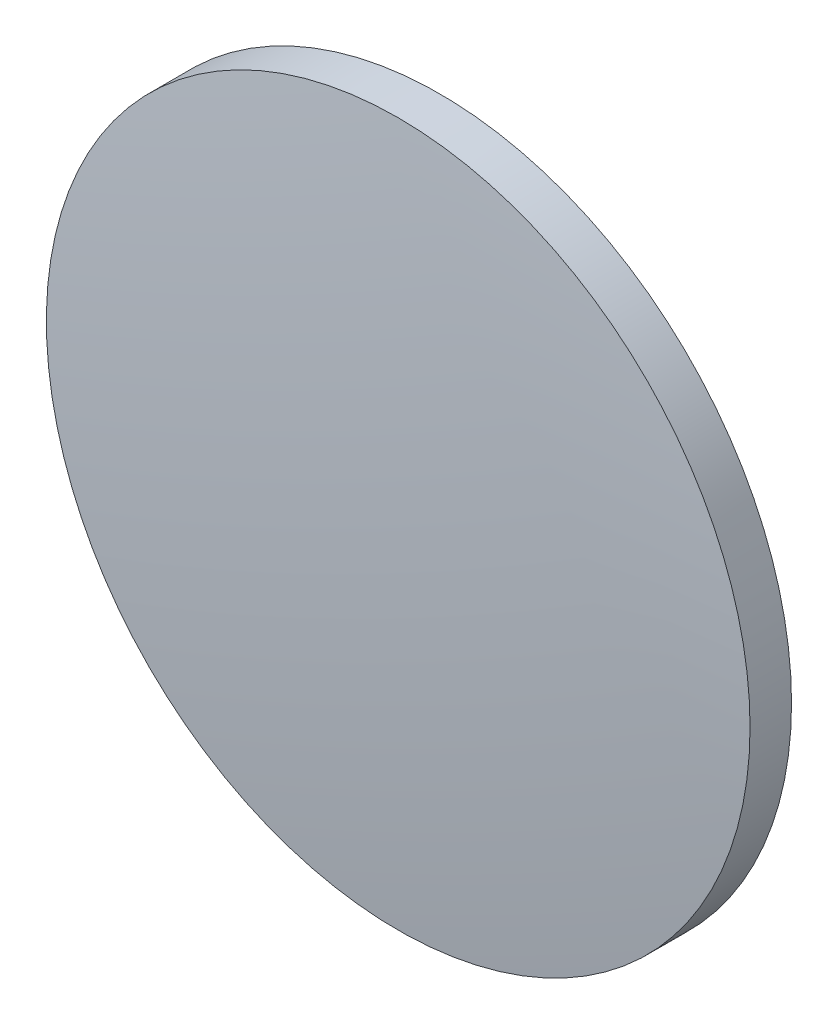
ISO-10303-21;
HEADER;
FILE_DESCRIPTION(('STEP AP214'),'2;1');
FILE_NAME('part.step','',(''),(''),'','','');
FILE_SCHEMA(('AUTOMOTIVE_DESIGN { 1 0 10303 214 1 1 1 1 }'));
ENDSEC;
DATA;
#1=APPLICATION_CONTEXT('core data for automotive mechanical design processes');
#2=APPLICATION_PROTOCOL_DEFINITION('international standard','automotive_design',2000,#1);
#3=PRODUCT_CONTEXT('',#1,'mechanical');
#4=PRODUCT('Part','Part','',(#3));
#5=PRODUCT_RELATED_PRODUCT_CATEGORY('part','',(#4));
#6=PRODUCT_DEFINITION_FORMATION('','',#4);
#7=PRODUCT_DEFINITION_CONTEXT('part definition',#1,'design');
#8=PRODUCT_DEFINITION('design','',#6,#7);
#9=PRODUCT_DEFINITION_SHAPE('','',#8);
#10=(LENGTH_UNIT() NAMED_UNIT(*) SI_UNIT(.MILLI.,.METRE.));
#11=(NAMED_UNIT(*) PLANE_ANGLE_UNIT() SI_UNIT($,.RADIAN.));
#12=(NAMED_UNIT(*) SI_UNIT($,.STERADIAN.) SOLID_ANGLE_UNIT());
#13=UNCERTAINTY_MEASURE_WITH_UNIT(LENGTH_MEASURE(1.E-05),#10,'distance_accuracy_value','');
#14=(GEOMETRIC_REPRESENTATION_CONTEXT(3) GLOBAL_UNCERTAINTY_ASSIGNED_CONTEXT((#13)) GLOBAL_UNIT_ASSIGNED_CONTEXT((#10,
#11,#12)) REPRESENTATION_CONTEXT('',''));
#15=CARTESIAN_POINT('',(0.,0.,0.));
#16=DIRECTION('',(0.,0.,1.));
#17=DIRECTION('',(1.,0.,0.));
#18=AXIS2_PLACEMENT_3D('',#15,#16,#17);
#19=CARTESIAN_POINT('',(0.,0.,-255.415));
#20=DIRECTION('',(0.,0.,1.));
#21=DIRECTION('',(0.,1.,0.));
#22=AXIS2_PLACEMENT_3D('',#19,#20,#21);
#23=SPHERICAL_SURFACE('',#22,257.54);
#24=CARTESIAN_POINT('',(0.,0.,0.869395935452938));
#25=DIRECTION('',(0.,0.,1.));
#26=DIRECTION('',(1.,0.,0.));
#27=AXIS2_PLACEMENT_3D('',#24,#25,#26);
#28=CIRCLE('',#27,25.4);
#29=CARTESIAN_POINT('',(25.4,0.,0.869395935452938));
#30=VERTEX_POINT('',#29);
#31=EDGE_CURVE('E10',#30,#30,#28,.T.);
#32=ORIENTED_EDGE('',*,*,#31,.T.);
#33=EDGE_LOOP('',(#32));
#34=FACE_BOUND('',#33,.T.);
#35=ADVANCED_FACE('F14',(#34),#23,.T.);
#36=CARTESIAN_POINT('',(0.,0.,4.30813204540037));
#37=DIRECTION('',(0.,0.,1.));
#38=DIRECTION('',(1.,0.,0.));
#39=AXIS2_PLACEMENT_3D('',#36,#37,#38);
#40=CYLINDRICAL_SURFACE('',#39,25.4);
#41=ORIENTED_EDGE('',*,*,#31,.F.);
#42=EDGE_LOOP('',(#41));
#43=FACE_BOUND('',#42,.T.);
#44=CARTESIAN_POINT('',(0.,0.,-2.125));
#45=DIRECTION('',(0.,0.,1.));
#46=DIRECTION('',(1.,0.,0.));
#47=AXIS2_PLACEMENT_3D('',#44,#45,#46);
#48=CIRCLE('',#47,25.4);
#49=CARTESIAN_POINT('',(25.4,0.,-2.125));
#50=VERTEX_POINT('',#49);
#51=EDGE_CURVE('E21',#50,#50,#48,.T.);
#52=ORIENTED_EDGE('',*,*,#51,.T.);
#53=EDGE_LOOP('',(#52));
#54=FACE_BOUND('',#53,.T.);
#55=ADVANCED_FACE('F29',(#43,#54),#40,.T.);
#56=CARTESIAN_POINT('',(0.,0.,-2.125));
#57=DIRECTION('',(0.,0.,1.));
#58=DIRECTION('',(1.,0.,0.));
#59=AXIS2_PLACEMENT_3D('',#56,#57,#58);
#60=PLANE('',#59);
#61=ORIENTED_EDGE('',*,*,#51,.F.);
#62=EDGE_LOOP('',(#61));
#63=FACE_BOUND('',#62,.T.);
#64=ADVANCED_FACE('F31',(#63),#60,.F.);
#65=CLOSED_SHELL('',(#35,#55,#64));
#66=MANIFOLD_SOLID_BREP('B1',#65);
#67=ADVANCED_BREP_SHAPE_REPRESENTATION('',(#18,#66),#14);
#68=SHAPE_DEFINITION_REPRESENTATION(#9,#67);
ENDSEC;
END-ISO-10303-21;
